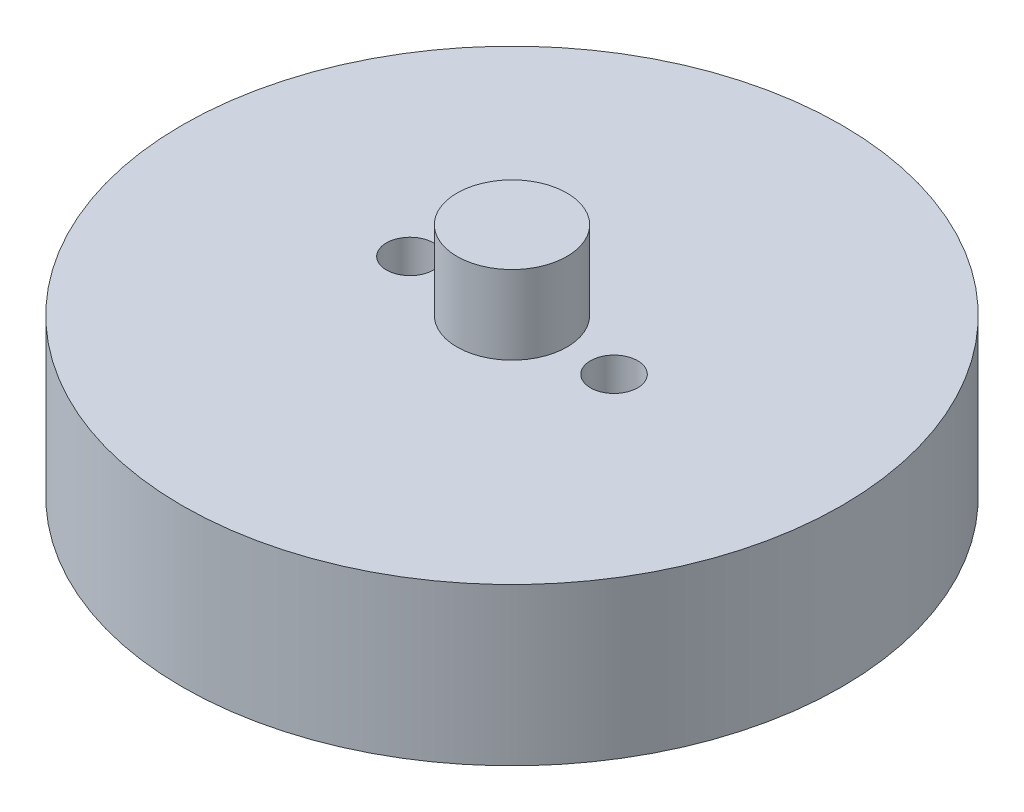
ISO-10303-21;
HEADER;
FILE_DESCRIPTION(('STEP AP214'),'2;1');
FILE_NAME('part.step','',(''),(''),'','','');
FILE_SCHEMA(('AUTOMOTIVE_DESIGN { 1 0 10303 214 1 1 1 1 }'));
ENDSEC;
DATA;
#1=APPLICATION_CONTEXT('core data for automotive mechanical design processes');
#2=APPLICATION_PROTOCOL_DEFINITION('international standard','automotive_design',2000,#1);
#3=PRODUCT_CONTEXT('',#1,'mechanical');
#4=PRODUCT('Part','Part','',(#3));
#5=PRODUCT_RELATED_PRODUCT_CATEGORY('part','',(#4));
#6=PRODUCT_DEFINITION_FORMATION('','',#4);
#7=PRODUCT_DEFINITION_CONTEXT('part definition',#1,'design');
#8=PRODUCT_DEFINITION('design','',#6,#7);
#9=PRODUCT_DEFINITION_SHAPE('','',#8);
#10=(LENGTH_UNIT() NAMED_UNIT(*) SI_UNIT(.MILLI.,.METRE.));
#11=(NAMED_UNIT(*) PLANE_ANGLE_UNIT() SI_UNIT($,.RADIAN.));
#12=(NAMED_UNIT(*) SI_UNIT($,.STERADIAN.) SOLID_ANGLE_UNIT());
#13=UNCERTAINTY_MEASURE_WITH_UNIT(LENGTH_MEASURE(1.E-05),#10,'distance_accuracy_value','');
#14=(GEOMETRIC_REPRESENTATION_CONTEXT(3) GLOBAL_UNCERTAINTY_ASSIGNED_CONTEXT((#13)) GLOBAL_UNIT_ASSIGNED_CONTEXT((#10,
#11,#12)) REPRESENTATION_CONTEXT('',''));
#15=CARTESIAN_POINT('',(0.,0.,0.));
#16=DIRECTION('',(0.,0.,1.));
#17=DIRECTION('',(1.,0.,0.));
#18=AXIS2_PLACEMENT_3D('',#15,#16,#17);
#19=CARTESIAN_POINT('',(0.,10.,0.));
#20=DIRECTION('',(0.,1.,0.));
#21=DIRECTION('',(0.,0.,1.));
#22=AXIS2_PLACEMENT_3D('',#19,#20,#21);
#23=PLANE('',#22);
#24=CARTESIAN_POINT('',(0.,10.,0.));
#25=DIRECTION('',(0.,1.,0.));
#26=DIRECTION('',(0.,0.,1.));
#27=AXIS2_PLACEMENT_3D('',#24,#25,#26);
#28=CIRCLE('',#27,3.5);
#29=CARTESIAN_POINT('',(0.,10.,3.5));
#30=VERTEX_POINT('',#29);
#31=EDGE_CURVE('E57',#30,#30,#28,.T.);
#32=ORIENTED_EDGE('',*,*,#31,.F.);
#33=EDGE_LOOP('',(#32));
#34=FACE_BOUND('',#33,.T.);
#35=CARTESIAN_POINT('',(-6.50000000000001,10.,0.));
#36=DIRECTION('',(0.,1.,0.));
#37=DIRECTION('',(0.,0.,1.));
#38=AXIS2_PLACEMENT_3D('',#35,#36,#37);
#39=CIRCLE('',#38,1.5);
#40=CARTESIAN_POINT('',(-6.50000000000001,10.,1.5));
#41=VERTEX_POINT('',#40);
#42=EDGE_CURVE('E43',#41,#41,#39,.T.);
#43=ORIENTED_EDGE('',*,*,#42,.F.);
#44=EDGE_LOOP('',(#43));
#45=FACE_BOUND('',#44,.T.);
#46=CARTESIAN_POINT('',(0.,10.,0.));
#47=DIRECTION('',(0.,1.,0.));
#48=DIRECTION('',(0.,0.,1.));
#49=AXIS2_PLACEMENT_3D('',#46,#47,#48);
#50=CIRCLE('',#49,21.);
#51=CARTESIAN_POINT('',(0.,10.,21.));
#52=VERTEX_POINT('',#51);
#53=EDGE_CURVE('E10',#52,#52,#50,.T.);
#54=ORIENTED_EDGE('',*,*,#53,.T.);
#55=EDGE_LOOP('',(#54));
#56=FACE_BOUND('',#55,.T.);
#57=CARTESIAN_POINT('',(6.50000000000001,10.,0.));
#58=DIRECTION('',(0.,1.,0.));
#59=DIRECTION('',(0.,0.,1.));
#60=AXIS2_PLACEMENT_3D('',#57,#58,#59);
#61=CIRCLE('',#60,1.5);
#62=CARTESIAN_POINT('',(6.50000000000001,10.,1.49999999999999));
#63=VERTEX_POINT('',#62);
#64=EDGE_CURVE('E48',#63,#63,#61,.T.);
#65=ORIENTED_EDGE('',*,*,#64,.F.);
#66=EDGE_LOOP('',(#65));
#67=FACE_BOUND('',#66,.T.);
#68=ADVANCED_FACE('F32',(#34,#45,#56,#67),#23,.T.);
#69=CARTESIAN_POINT('',(0.,0.,0.));
#70=DIRECTION('',(0.,1.,0.));
#71=DIRECTION('',(0.,0.,1.));
#72=AXIS2_PLACEMENT_3D('',#69,#70,#71);
#73=PLANE('',#72);
#74=CARTESIAN_POINT('',(0.,0.,0.));
#75=DIRECTION('',(0.,1.,0.));
#76=DIRECTION('',(0.,0.,1.));
#77=AXIS2_PLACEMENT_3D('',#74,#75,#76);
#78=CIRCLE('',#77,21.);
#79=CARTESIAN_POINT('',(0.,0.,21.));
#80=VERTEX_POINT('',#79);
#81=EDGE_CURVE('E36',#80,#80,#78,.T.);
#82=ORIENTED_EDGE('',*,*,#81,.F.);
#83=EDGE_LOOP('',(#82));
#84=FACE_BOUND('',#83,.T.);
#85=CARTESIAN_POINT('',(-6.50000000000001,0.,0.));
#86=DIRECTION('',(0.,1.,0.));
#87=DIRECTION('',(0.,0.,1.));
#88=AXIS2_PLACEMENT_3D('',#85,#86,#87);
#89=CIRCLE('',#88,1.5);
#90=CARTESIAN_POINT('',(-6.50000000000001,0.,1.5));
#91=VERTEX_POINT('',#90);
#92=EDGE_CURVE('E45',#91,#91,#89,.T.);
#93=ORIENTED_EDGE('',*,*,#92,.T.);
#94=EDGE_LOOP('',(#93));
#95=FACE_BOUND('',#94,.T.);
#96=CARTESIAN_POINT('',(6.50000000000001,0.,0.));
#97=DIRECTION('',(0.,1.,0.));
#98=DIRECTION('',(0.,0.,1.));
#99=AXIS2_PLACEMENT_3D('',#96,#97,#98);
#100=CIRCLE('',#99,1.5);
#101=CARTESIAN_POINT('',(6.50000000000001,0.,1.49999999999999));
#102=VERTEX_POINT('',#101);
#103=EDGE_CURVE('E51',#102,#102,#100,.T.);
#104=ORIENTED_EDGE('',*,*,#103,.T.);
#105=EDGE_LOOP('',(#104));
#106=FACE_BOUND('',#105,.T.);
#107=ADVANCED_FACE('F74',(#84,#95,#106),#73,.F.);
#108=CARTESIAN_POINT('',(0.,10.,0.));
#109=DIRECTION('',(0.,-1.,0.));
#110=DIRECTION('',(0.,0.,-1.));
#111=AXIS2_PLACEMENT_3D('',#108,#109,#110);
#112=CYLINDRICAL_SURFACE('',#111,21.);
#113=ORIENTED_EDGE('',*,*,#53,.F.);
#114=EDGE_LOOP('',(#113));
#115=FACE_BOUND('',#114,.T.);
#116=ORIENTED_EDGE('',*,*,#81,.T.);
#117=EDGE_LOOP('',(#116));
#118=FACE_BOUND('',#117,.T.);
#119=ADVANCED_FACE('F34',(#115,#118),#112,.T.);
#120=CARTESIAN_POINT('',(-6.50000000000001,10.,0.));
#121=DIRECTION('',(0.,-1.,0.));
#122=DIRECTION('',(0.,0.,-1.));
#123=AXIS2_PLACEMENT_3D('',#120,#121,#122);
#124=CYLINDRICAL_SURFACE('',#123,1.5);
#125=ORIENTED_EDGE('',*,*,#42,.T.);
#126=EDGE_LOOP('',(#125));
#127=FACE_BOUND('',#126,.T.);
#128=ORIENTED_EDGE('',*,*,#92,.F.);
#129=EDGE_LOOP('',(#128));
#130=FACE_BOUND('',#129,.T.);
#131=ADVANCED_FACE('F82',(#127,#130),#124,.F.);
#132=CARTESIAN_POINT('',(6.50000000000001,10.,0.));
#133=DIRECTION('',(0.,-1.,0.));
#134=DIRECTION('',(0.,0.,-1.));
#135=AXIS2_PLACEMENT_3D('',#132,#133,#134);
#136=CYLINDRICAL_SURFACE('',#135,1.5);
#137=ORIENTED_EDGE('',*,*,#64,.T.);
#138=EDGE_LOOP('',(#137));
#139=FACE_BOUND('',#138,.T.);
#140=ORIENTED_EDGE('',*,*,#103,.F.);
#141=EDGE_LOOP('',(#140));
#142=FACE_BOUND('',#141,.T.);
#143=ADVANCED_FACE('F68',(#139,#142),#136,.F.);
#144=CARTESIAN_POINT('',(0.,15.,0.));
#145=DIRECTION('',(0.,-1.,0.));
#146=DIRECTION('',(0.,0.,-1.));
#147=AXIS2_PLACEMENT_3D('',#144,#145,#146);
#148=CYLINDRICAL_SURFACE('',#147,3.5);
#149=CARTESIAN_POINT('',(0.,15.,0.));
#150=DIRECTION('',(0.,1.,0.));
#151=DIRECTION('',(0.,0.,1.));
#152=AXIS2_PLACEMENT_3D('',#149,#150,#151);
#153=CIRCLE('',#152,3.5);
#154=CARTESIAN_POINT('',(0.,15.,3.5));
#155=VERTEX_POINT('',#154);
#156=EDGE_CURVE('E54',#155,#155,#153,.T.);
#157=ORIENTED_EDGE('',*,*,#156,.F.);
#158=EDGE_LOOP('',(#157));
#159=FACE_BOUND('',#158,.T.);
#160=ORIENTED_EDGE('',*,*,#31,.T.);
#161=EDGE_LOOP('',(#160));
#162=FACE_BOUND('',#161,.T.);
#163=ADVANCED_FACE('F65',(#159,#162),#148,.T.);
#164=CARTESIAN_POINT('',(0.,15.,0.));
#165=DIRECTION('',(0.,1.,0.));
#166=DIRECTION('',(0.,0.,1.));
#167=AXIS2_PLACEMENT_3D('',#164,#165,#166);
#168=PLANE('',#167);
#169=ORIENTED_EDGE('',*,*,#156,.T.);
#170=EDGE_LOOP('',(#169));
#171=FACE_BOUND('',#170,.T.);
#172=ADVANCED_FACE('F63',(#171),#168,.T.);
#173=CLOSED_SHELL('',(#68,#107,#119,#131,#143,#163,#172));
#174=MANIFOLD_SOLID_BREP('B2',#173);
#175=ADVANCED_BREP_SHAPE_REPRESENTATION('',(#18,#174),#14);
#176=SHAPE_DEFINITION_REPRESENTATION(#9,#175);
ENDSEC;
END-ISO-10303-21;
